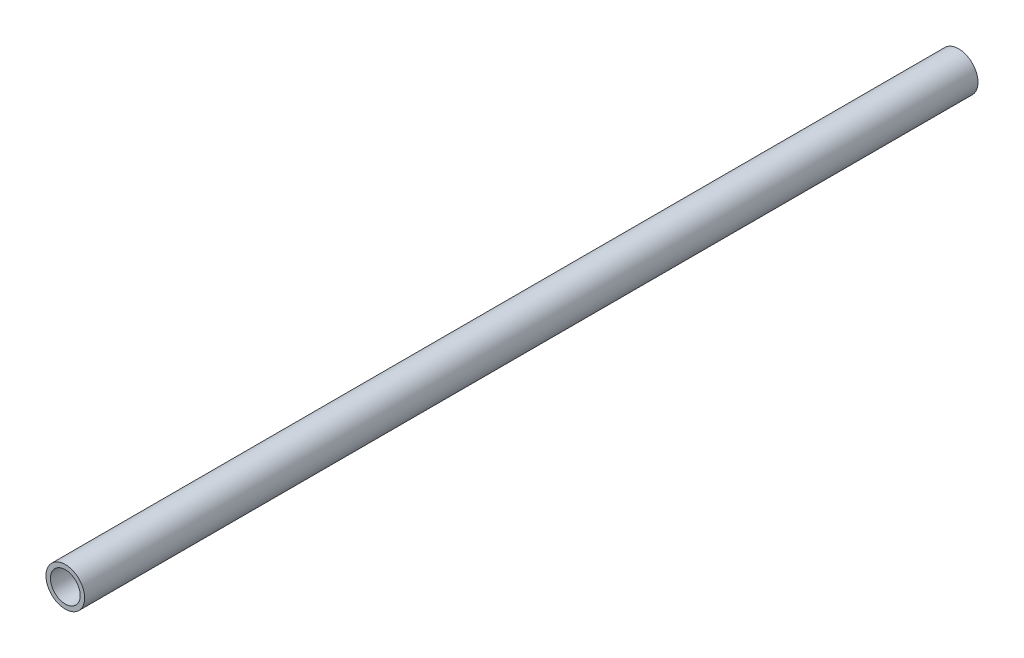
ISO-10303-21;
HEADER;
FILE_DESCRIPTION(('STEP AP214'),'2;1');
FILE_NAME('part.step','',(''),(''),'','','');
FILE_SCHEMA(('AUTOMOTIVE_DESIGN { 1 0 10303 214 1 1 1 1 }'));
ENDSEC;
DATA;
#1=APPLICATION_CONTEXT('core data for automotive mechanical design processes');
#2=APPLICATION_PROTOCOL_DEFINITION('international standard','automotive_design',2000,#1);
#3=PRODUCT_CONTEXT('',#1,'mechanical');
#4=PRODUCT('Part','Part','',(#3));
#5=PRODUCT_RELATED_PRODUCT_CATEGORY('part','',(#4));
#6=PRODUCT_DEFINITION_FORMATION('','',#4);
#7=PRODUCT_DEFINITION_CONTEXT('part definition',#1,'design');
#8=PRODUCT_DEFINITION('design','',#6,#7);
#9=PRODUCT_DEFINITION_SHAPE('','',#8);
#10=(LENGTH_UNIT() NAMED_UNIT(*) SI_UNIT(.MILLI.,.METRE.));
#11=(NAMED_UNIT(*) PLANE_ANGLE_UNIT() SI_UNIT($,.RADIAN.));
#12=(NAMED_UNIT(*) SI_UNIT($,.STERADIAN.) SOLID_ANGLE_UNIT());
#13=UNCERTAINTY_MEASURE_WITH_UNIT(LENGTH_MEASURE(1.E-05),#10,'distance_accuracy_value','');
#14=(GEOMETRIC_REPRESENTATION_CONTEXT(3) GLOBAL_UNCERTAINTY_ASSIGNED_CONTEXT((#13)) GLOBAL_UNIT_ASSIGNED_CONTEXT((#10,
#11,#12)) REPRESENTATION_CONTEXT('',''));
#15=CARTESIAN_POINT('',(0.,0.,0.));
#16=DIRECTION('',(0.,0.,1.));
#17=DIRECTION('',(1.,0.,0.));
#18=AXIS2_PLACEMENT_3D('',#15,#16,#17);
#19=CARTESIAN_POINT('',(0.,0.,150.));
#20=DIRECTION('',(0.,0.,1.));
#21=DIRECTION('',(1.,0.,0.));
#22=AXIS2_PLACEMENT_3D('',#19,#20,#21);
#23=PLANE('',#22);
#24=CARTESIAN_POINT('',(0.,0.,150.));
#25=DIRECTION('',(0.,0.,1.));
#26=DIRECTION('',(1.,0.,0.));
#27=AXIS2_PLACEMENT_3D('',#24,#25,#26);
#28=CIRCLE('',#27,6.5);
#29=CARTESIAN_POINT('',(6.5,0.,150.));
#30=VERTEX_POINT('',#29);
#31=EDGE_CURVE('E10',#30,#30,#28,.T.);
#32=ORIENTED_EDGE('',*,*,#31,.T.);
#33=EDGE_LOOP('',(#32));
#34=FACE_BOUND('',#33,.T.);
#35=CARTESIAN_POINT('',(0.,0.,150.));
#36=DIRECTION('',(0.,0.,1.));
#37=DIRECTION('',(1.,0.,0.));
#38=AXIS2_PLACEMENT_3D('',#35,#36,#37);
#39=CIRCLE('',#38,5.);
#40=CARTESIAN_POINT('',(5.,0.,150.));
#41=VERTEX_POINT('',#40);
#42=EDGE_CURVE('E52',#41,#41,#39,.T.);
#43=ORIENTED_EDGE('',*,*,#42,.F.);
#44=EDGE_LOOP('',(#43));
#45=FACE_BOUND('',#44,.T.);
#46=ADVANCED_FACE('F39',(#34,#45),#23,.T.);
#47=CARTESIAN_POINT('',(0.,0.,-150.));
#48=DIRECTION('',(0.,0.,1.));
#49=DIRECTION('',(1.,0.,0.));
#50=AXIS2_PLACEMENT_3D('',#47,#48,#49);
#51=PLANE('',#50);
#52=CARTESIAN_POINT('',(0.,0.,-150.));
#53=DIRECTION('',(0.,0.,1.));
#54=DIRECTION('',(1.,0.,0.));
#55=AXIS2_PLACEMENT_3D('',#52,#53,#54);
#56=CIRCLE('',#55,6.5);
#57=CARTESIAN_POINT('',(6.5,0.,-150.));
#58=VERTEX_POINT('',#57);
#59=EDGE_CURVE('E43',#58,#58,#56,.T.);
#60=ORIENTED_EDGE('',*,*,#59,.F.);
#61=EDGE_LOOP('',(#60));
#62=FACE_BOUND('',#61,.T.);
#63=CARTESIAN_POINT('',(0.,0.,-150.));
#64=DIRECTION('',(0.,0.,1.));
#65=DIRECTION('',(1.,0.,0.));
#66=AXIS2_PLACEMENT_3D('',#63,#64,#65);
#67=CIRCLE('',#66,5.);
#68=CARTESIAN_POINT('',(5.,0.,-150.));
#69=VERTEX_POINT('',#68);
#70=EDGE_CURVE('E54',#69,#69,#67,.T.);
#71=ORIENTED_EDGE('',*,*,#70,.T.);
#72=EDGE_LOOP('',(#71));
#73=FACE_BOUND('',#72,.T.);
#74=ADVANCED_FACE('F66',(#62,#73),#51,.F.);
#75=CARTESIAN_POINT('',(0.,0.,150.));
#76=DIRECTION('',(0.,0.,-1.));
#77=DIRECTION('',(-1.,0.,0.));
#78=AXIS2_PLACEMENT_3D('',#75,#76,#77);
#79=CYLINDRICAL_SURFACE('',#78,6.5);
#80=ORIENTED_EDGE('',*,*,#31,.F.);
#81=EDGE_LOOP('',(#80));
#82=FACE_BOUND('',#81,.T.);
#83=ORIENTED_EDGE('',*,*,#59,.T.);
#84=EDGE_LOOP('',(#83));
#85=FACE_BOUND('',#84,.T.);
#86=ADVANCED_FACE('F41',(#82,#85),#79,.T.);
#87=CARTESIAN_POINT('',(0.,0.,150.));
#88=DIRECTION('',(0.,0.,-1.));
#89=DIRECTION('',(-1.,0.,0.));
#90=AXIS2_PLACEMENT_3D('',#87,#88,#89);
#91=CYLINDRICAL_SURFACE('',#90,5.);
#92=ORIENTED_EDGE('',*,*,#42,.T.);
#93=EDGE_LOOP('',(#92));
#94=FACE_BOUND('',#93,.T.);
#95=ORIENTED_EDGE('',*,*,#70,.F.);
#96=EDGE_LOOP('',(#95));
#97=FACE_BOUND('',#96,.T.);
#98=ADVANCED_FACE('F62',(#94,#97),#91,.F.);
#99=CLOSED_SHELL('',(#46,#74,#86,#98));
#100=MANIFOLD_SOLID_BREP('B2',#99);
#101=ADVANCED_BREP_SHAPE_REPRESENTATION('',(#18,#100),#14);
#102=SHAPE_DEFINITION_REPRESENTATION(#9,#101);
ENDSEC;
END-ISO-10303-21;
